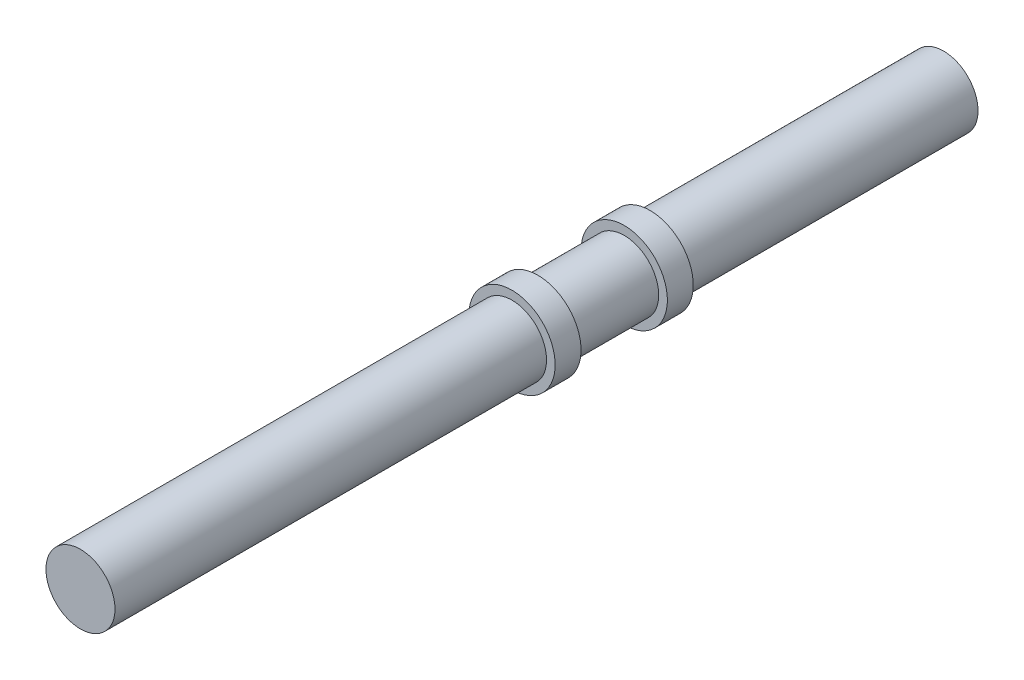
ISO-10303-21;
HEADER;
FILE_DESCRIPTION(('STEP AP214'),'2;1');
FILE_NAME('part.step','',(''),(''),'','','');
FILE_SCHEMA(('AUTOMOTIVE_DESIGN { 1 0 10303 214 1 1 1 1 }'));
ENDSEC;
DATA;
#1=APPLICATION_CONTEXT('core data for automotive mechanical design processes');
#2=APPLICATION_PROTOCOL_DEFINITION('international standard','automotive_design',2000,#1);
#3=PRODUCT_CONTEXT('',#1,'mechanical');
#4=PRODUCT('Part','Part','',(#3));
#5=PRODUCT_RELATED_PRODUCT_CATEGORY('part','',(#4));
#6=PRODUCT_DEFINITION_FORMATION('','',#4);
#7=PRODUCT_DEFINITION_CONTEXT('part definition',#1,'design');
#8=PRODUCT_DEFINITION('design','',#6,#7);
#9=PRODUCT_DEFINITION_SHAPE('','',#8);
#10=(LENGTH_UNIT() NAMED_UNIT(*) SI_UNIT(.MILLI.,.METRE.));
#11=(NAMED_UNIT(*) PLANE_ANGLE_UNIT() SI_UNIT($,.RADIAN.));
#12=(NAMED_UNIT(*) SI_UNIT($,.STERADIAN.) SOLID_ANGLE_UNIT());
#13=UNCERTAINTY_MEASURE_WITH_UNIT(LENGTH_MEASURE(1.E-05),#10,'distance_accuracy_value','');
#14=(GEOMETRIC_REPRESENTATION_CONTEXT(3) GLOBAL_UNCERTAINTY_ASSIGNED_CONTEXT((#13)) GLOBAL_UNIT_ASSIGNED_CONTEXT((#10,
#11,#12)) REPRESENTATION_CONTEXT('',''));
#15=CARTESIAN_POINT('',(0.,0.,0.));
#16=DIRECTION('',(0.,0.,1.));
#17=DIRECTION('',(1.,0.,0.));
#18=AXIS2_PLACEMENT_3D('',#15,#16,#17);
#19=CARTESIAN_POINT('',(0.,0.,50.));
#20=DIRECTION('',(0.,0.,-1.));
#21=DIRECTION('',(-1.,0.,0.));
#22=AXIS2_PLACEMENT_3D('',#19,#20,#21);
#23=CYLINDRICAL_SURFACE('',#22,4.);
#24=CARTESIAN_POINT('',(0.,0.,50.));
#25=DIRECTION('',(0.,0.,1.));
#26=DIRECTION('',(1.,0.,0.));
#27=AXIS2_PLACEMENT_3D('',#24,#25,#26);
#28=CIRCLE('',#27,4.);
#29=CARTESIAN_POINT('',(4.,0.,50.));
#30=VERTEX_POINT('',#29);
#31=EDGE_CURVE('E51',#30,#30,#28,.T.);
#32=ORIENTED_EDGE('',*,*,#31,.F.);
#33=EDGE_LOOP('',(#32));
#34=FACE_BOUND('',#33,.T.);
#35=CARTESIAN_POINT('',(0.,0.,0.));
#36=DIRECTION('',(0.,0.,1.));
#37=DIRECTION('',(1.,0.,0.));
#38=AXIS2_PLACEMENT_3D('',#35,#36,#37);
#39=CIRCLE('',#38,4.);
#40=CARTESIAN_POINT('',(4.,0.,0.));
#41=VERTEX_POINT('',#40);
#42=EDGE_CURVE('E42',#41,#41,#39,.T.);
#43=ORIENTED_EDGE('',*,*,#42,.T.);
#44=EDGE_LOOP('',(#43));
#45=FACE_BOUND('',#44,.T.);
#46=ADVANCED_FACE('F39',(#34,#45),#23,.T.);
#47=CARTESIAN_POINT('',(0.,0.,50.));
#48=DIRECTION('',(0.,0.,1.));
#49=DIRECTION('',(1.,0.,0.));
#50=AXIS2_PLACEMENT_3D('',#47,#48,#49);
#51=PLANE('',#50);
#52=ORIENTED_EDGE('',*,*,#31,.T.);
#53=EDGE_LOOP('',(#52));
#54=FACE_BOUND('',#53,.T.);
#55=ADVANCED_FACE('F87',(#54),#51,.T.);
#56=CARTESIAN_POINT('',(0.,0.,-3.));
#57=DIRECTION('',(0.,0.,1.));
#58=DIRECTION('',(1.,0.,0.));
#59=AXIS2_PLACEMENT_3D('',#56,#57,#58);
#60=CYLINDRICAL_SURFACE('',#59,5.);
#61=CARTESIAN_POINT('',(0.,0.,-3.));
#62=DIRECTION('',(0.,0.,-1.));
#63=DIRECTION('',(-1.,0.,0.));
#64=AXIS2_PLACEMENT_3D('',#61,#62,#63);
#65=CIRCLE('',#64,5.);
#66=CARTESIAN_POINT('',(-5.,0.,-3.));
#67=VERTEX_POINT('',#66);
#68=EDGE_CURVE('E66',#67,#67,#65,.T.);
#69=ORIENTED_EDGE('',*,*,#68,.F.);
#70=EDGE_LOOP('',(#69));
#71=FACE_BOUND('',#70,.T.);
#72=CARTESIAN_POINT('',(0.,0.,0.));
#73=DIRECTION('',(0.,0.,-1.));
#74=DIRECTION('',(-1.,0.,0.));
#75=AXIS2_PLACEMENT_3D('',#72,#73,#74);
#76=CIRCLE('',#75,5.);
#77=CARTESIAN_POINT('',(-5.,0.,0.));
#78=VERTEX_POINT('',#77);
#79=EDGE_CURVE('E64',#78,#78,#76,.T.);
#80=ORIENTED_EDGE('',*,*,#79,.T.);
#81=EDGE_LOOP('',(#80));
#82=FACE_BOUND('',#81,.T.);
#83=ADVANCED_FACE('F85',(#71,#82),#60,.T.);
#84=CARTESIAN_POINT('',(0.,0.,-3.));
#85=DIRECTION('',(0.,0.,-1.));
#86=DIRECTION('',(-1.,0.,0.));
#87=AXIS2_PLACEMENT_3D('',#84,#85,#86);
#88=PLANE('',#87);
#89=CARTESIAN_POINT('',(0.,0.,-3.));
#90=DIRECTION('',(0.,0.,-1.));
#91=DIRECTION('',(-1.,0.,0.));
#92=AXIS2_PLACEMENT_3D('',#89,#90,#91);
#93=CIRCLE('',#92,4.);
#94=CARTESIAN_POINT('',(-4.,0.,-3.));
#95=VERTEX_POINT('',#94);
#96=EDGE_CURVE('E46',#95,#95,#93,.T.);
#97=ORIENTED_EDGE('',*,*,#96,.F.);
#98=EDGE_LOOP('',(#97));
#99=FACE_BOUND('',#98,.T.);
#100=ORIENTED_EDGE('',*,*,#68,.T.);
#101=EDGE_LOOP('',(#100));
#102=FACE_BOUND('',#101,.T.);
#103=ADVANCED_FACE('F81',(#99,#102),#88,.T.);
#104=CARTESIAN_POINT('',(0.,0.,0.));
#105=DIRECTION('',(0.,0.,-1.));
#106=DIRECTION('',(-1.,0.,0.));
#107=AXIS2_PLACEMENT_3D('',#104,#105,#106);
#108=PLANE('',#107);
#109=ORIENTED_EDGE('',*,*,#42,.F.);
#110=EDGE_LOOP('',(#109));
#111=FACE_BOUND('',#110,.T.);
#112=ORIENTED_EDGE('',*,*,#79,.F.);
#113=EDGE_LOOP('',(#112));
#114=FACE_BOUND('',#113,.T.);
#115=ADVANCED_FACE('F77',(#111,#114),#108,.F.);
#116=CARTESIAN_POINT('',(0.,0.,-13.));
#117=DIRECTION('',(0.,0.,1.));
#118=DIRECTION('',(1.,0.,0.));
#119=AXIS2_PLACEMENT_3D('',#116,#117,#118);
#120=CYLINDRICAL_SURFACE('',#119,4.);
#121=CARTESIAN_POINT('',(0.,0.,-13.));
#122=DIRECTION('',(0.,0.,-1.));
#123=DIRECTION('',(-1.,0.,0.));
#124=AXIS2_PLACEMENT_3D('',#121,#122,#123);
#125=CIRCLE('',#124,4.);
#126=CARTESIAN_POINT('',(-4.,0.,-13.));
#127=VERTEX_POINT('',#126);
#128=EDGE_CURVE('E59',#127,#127,#125,.T.);
#129=ORIENTED_EDGE('',*,*,#128,.F.);
#130=EDGE_LOOP('',(#129));
#131=FACE_BOUND('',#130,.T.);
#132=ORIENTED_EDGE('',*,*,#96,.T.);
#133=EDGE_LOOP('',(#132));
#134=FACE_BOUND('',#133,.T.);
#135=ADVANCED_FACE('F80',(#131,#134),#120,.T.);
#136=CARTESIAN_POINT('',(0.,0.,-16.));
#137=DIRECTION('',(0.,0.,1.));
#138=DIRECTION('',(1.,0.,0.));
#139=AXIS2_PLACEMENT_3D('',#136,#137,#138);
#140=CYLINDRICAL_SURFACE('',#139,5.);
#141=CARTESIAN_POINT('',(0.,0.,-16.));
#142=DIRECTION('',(0.,0.,-1.));
#143=DIRECTION('',(-1.,0.,0.));
#144=AXIS2_PLACEMENT_3D('',#141,#142,#143);
#145=CIRCLE('',#144,5.);
#146=CARTESIAN_POINT('',(-5.,0.,-16.));
#147=VERTEX_POINT('',#146);
#148=EDGE_CURVE('E56',#147,#147,#145,.T.);
#149=ORIENTED_EDGE('',*,*,#148,.F.);
#150=EDGE_LOOP('',(#149));
#151=FACE_BOUND('',#150,.T.);
#152=CARTESIAN_POINT('',(0.,0.,-13.));
#153=DIRECTION('',(0.,0.,-1.));
#154=DIRECTION('',(-1.,0.,0.));
#155=AXIS2_PLACEMENT_3D('',#152,#153,#154);
#156=CIRCLE('',#155,5.);
#157=CARTESIAN_POINT('',(-5.,0.,-13.));
#158=VERTEX_POINT('',#157);
#159=EDGE_CURVE('E60',#158,#158,#156,.T.);
#160=ORIENTED_EDGE('',*,*,#159,.T.);
#161=EDGE_LOOP('',(#160));
#162=FACE_BOUND('',#161,.T.);
#163=ADVANCED_FACE('F132',(#151,#162),#140,.T.);
#164=CARTESIAN_POINT('',(0.,0.,-16.));
#165=DIRECTION('',(0.,0.,-1.));
#166=DIRECTION('',(-1.,0.,0.));
#167=AXIS2_PLACEMENT_3D('',#164,#165,#166);
#168=PLANE('',#167);
#169=CARTESIAN_POINT('',(0.,0.,-16.));
#170=DIRECTION('',(0.,0.,-1.));
#171=DIRECTION('',(-1.,0.,0.));
#172=AXIS2_PLACEMENT_3D('',#169,#170,#171);
#173=CIRCLE('',#172,4.);
#174=CARTESIAN_POINT('',(-4.,0.,-16.));
#175=VERTEX_POINT('',#174);
#176=EDGE_CURVE('E10',#175,#175,#173,.T.);
#177=ORIENTED_EDGE('',*,*,#176,.F.);
#178=EDGE_LOOP('',(#177));
#179=FACE_BOUND('',#178,.T.);
#180=ORIENTED_EDGE('',*,*,#148,.T.);
#181=EDGE_LOOP('',(#180));
#182=FACE_BOUND('',#181,.T.);
#183=ADVANCED_FACE('F142',(#179,#182),#168,.T.);
#184=CARTESIAN_POINT('',(0.,0.,-13.));
#185=DIRECTION('',(0.,0.,-1.));
#186=DIRECTION('',(-1.,0.,0.));
#187=AXIS2_PLACEMENT_3D('',#184,#185,#186);
#188=PLANE('',#187);
#189=ORIENTED_EDGE('',*,*,#128,.T.);
#190=EDGE_LOOP('',(#189));
#191=FACE_BOUND('',#190,.T.);
#192=ORIENTED_EDGE('',*,*,#159,.F.);
#193=EDGE_LOOP('',(#192));
#194=FACE_BOUND('',#193,.T.);
#195=ADVANCED_FACE('F153',(#191,#194),#188,.F.);
#196=CARTESIAN_POINT('',(0.,0.,-50.));
#197=DIRECTION('',(0.,0.,1.));
#198=DIRECTION('',(1.,0.,0.));
#199=AXIS2_PLACEMENT_3D('',#196,#197,#198);
#200=CYLINDRICAL_SURFACE('',#199,4.);
#201=CARTESIAN_POINT('',(0.,0.,-50.));
#202=DIRECTION('',(0.,0.,-1.));
#203=DIRECTION('',(-1.,0.,0.));
#204=AXIS2_PLACEMENT_3D('',#201,#202,#203);
#205=CIRCLE('',#204,4.);
#206=CARTESIAN_POINT('',(-4.,0.,-50.));
#207=VERTEX_POINT('',#206);
#208=EDGE_CURVE('E55',#207,#207,#205,.T.);
#209=ORIENTED_EDGE('',*,*,#208,.F.);
#210=EDGE_LOOP('',(#209));
#211=FACE_BOUND('',#210,.T.);
#212=ORIENTED_EDGE('',*,*,#176,.T.);
#213=EDGE_LOOP('',(#212));
#214=FACE_BOUND('',#213,.T.);
#215=ADVANCED_FACE('F163',(#211,#214),#200,.T.);
#216=CARTESIAN_POINT('',(0.,0.,-50.));
#217=DIRECTION('',(0.,0.,-1.));
#218=DIRECTION('',(-1.,0.,0.));
#219=AXIS2_PLACEMENT_3D('',#216,#217,#218);
#220=PLANE('',#219);
#221=ORIENTED_EDGE('',*,*,#208,.T.);
#222=EDGE_LOOP('',(#221));
#223=FACE_BOUND('',#222,.T.);
#224=ADVANCED_FACE('F172',(#223),#220,.T.);
#225=CLOSED_SHELL('',(#46,#55,#83,#103,#115,#135,#163,#183,#195,#215,#224));
#226=MANIFOLD_SOLID_BREP('B2',#225);
#227=ADVANCED_BREP_SHAPE_REPRESENTATION('',(#18,#226),#14);
#228=SHAPE_DEFINITION_REPRESENTATION(#9,#227);
ENDSEC;
END-ISO-10303-21;
